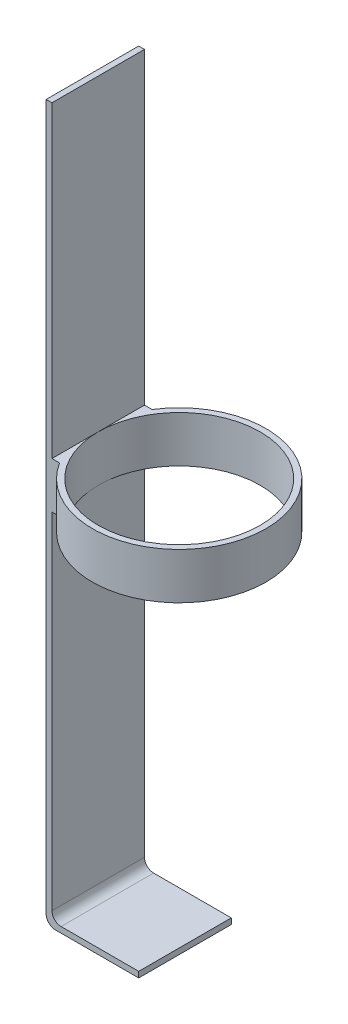
ISO-10303-21;
HEADER;
FILE_DESCRIPTION(('STEP AP214'),'2;1');
FILE_NAME('part.step','',(''),(''),'','','');
FILE_SCHEMA(('AUTOMOTIVE_DESIGN { 1 0 10303 214 1 1 1 1 }'));
ENDSEC;
DATA;
#1=APPLICATION_CONTEXT('core data for automotive mechanical design processes');
#2=APPLICATION_PROTOCOL_DEFINITION('international standard','automotive_design',2000,#1);
#3=PRODUCT_CONTEXT('',#1,'mechanical');
#4=PRODUCT('Part','Part','',(#3));
#5=PRODUCT_RELATED_PRODUCT_CATEGORY('part','',(#4));
#6=PRODUCT_DEFINITION_FORMATION('','',#4);
#7=PRODUCT_DEFINITION_CONTEXT('part definition',#1,'design');
#8=PRODUCT_DEFINITION('design','',#6,#7);
#9=PRODUCT_DEFINITION_SHAPE('','',#8);
#10=(LENGTH_UNIT() NAMED_UNIT(*) SI_UNIT(.MILLI.,.METRE.));
#11=(NAMED_UNIT(*) PLANE_ANGLE_UNIT() SI_UNIT($,.RADIAN.));
#12=(NAMED_UNIT(*) SI_UNIT($,.STERADIAN.) SOLID_ANGLE_UNIT());
#13=UNCERTAINTY_MEASURE_WITH_UNIT(LENGTH_MEASURE(1.E-05),#10,'distance_accuracy_value','');
#14=(GEOMETRIC_REPRESENTATION_CONTEXT(3) GLOBAL_UNCERTAINTY_ASSIGNED_CONTEXT((#13)) GLOBAL_UNIT_ASSIGNED_CONTEXT((#10,
#11,#12)) REPRESENTATION_CONTEXT('',''));
#15=CARTESIAN_POINT('',(0.,0.,0.));
#16=DIRECTION('',(0.,0.,1.));
#17=DIRECTION('',(1.,0.,0.));
#18=AXIS2_PLACEMENT_3D('',#15,#16,#17);
#19=CARTESIAN_POINT('',(3.175,0.,50.8));
#20=DIRECTION('',(1.,0.,0.));
#21=DIRECTION('',(0.,1.,0.));
#22=AXIS2_PLACEMENT_3D('',#19,#20,#21);
#23=PLANE('',#22);
#24=DIRECTION('',(0.,-1.,0.));
#25=VECTOR('',#24,1.);
#26=CARTESIAN_POINT('',(3.175,0.,0.));
#27=LINE('',#26,#25);
#28=CARTESIAN_POINT('',(3.17500000000002,-194.49375,0.));
#29=VERTEX_POINT('',#28);
#30=CARTESIAN_POINT('',(3.17500000000005,-383.9875,0.));
#31=VERTEX_POINT('',#30);
#32=EDGE_CURVE('E203',#29,#31,#27,.T.);
#33=ORIENTED_EDGE('',*,*,#32,.F.);
#34=DIRECTION('',(0.,0.,1.));
#35=VECTOR('',#34,1.);
#36=CARTESIAN_POINT('',(3.17500000000002,-194.49375,50.8));
#37=LINE('',#36,#35);
#38=CARTESIAN_POINT('',(3.17500000000003,-194.49375,25.4));
#39=VERTEX_POINT('',#38);
#40=EDGE_CURVE('E61',#29,#39,#37,.T.);
#41=ORIENTED_EDGE('',*,*,#40,.T.);
#42=CARTESIAN_POINT('',(3.175,-194.49375,50.8));
#43=VERTEX_POINT('',#42);
#44=EDGE_CURVE('E136',#39,#43,#37,.T.);
#45=ORIENTED_EDGE('',*,*,#44,.T.);
#46=DIRECTION('',(0.,-1.,0.));
#47=VECTOR('',#46,1.);
#48=CARTESIAN_POINT('',(3.175,0.,50.8));
#49=LINE('',#48,#47);
#50=CARTESIAN_POINT('',(3.17500000000005,-383.9875,50.8));
#51=VERTEX_POINT('',#50);
#52=EDGE_CURVE('E128',#43,#51,#49,.T.);
#53=ORIENTED_EDGE('',*,*,#52,.T.);
#54=DIRECTION('',(0.,0.,-1.));
#55=VECTOR('',#54,1.);
#56=CARTESIAN_POINT('',(3.17500000000005,-383.9875,50.8));
#57=LINE('',#56,#55);
#58=EDGE_CURVE('E132',#51,#31,#57,.T.);
#59=ORIENTED_EDGE('',*,*,#58,.T.);
#60=EDGE_LOOP('',(#33,#41,#45,#53,#59));
#61=FACE_BOUND('',#60,.T.);
#62=ADVANCED_FACE('F45',(#61),#23,.T.);
#63=CARTESIAN_POINT('',(0.,0.,50.8));
#64=DIRECTION('',(1.,0.,0.));
#65=DIRECTION('',(0.,1.,0.));
#66=AXIS2_PLACEMENT_3D('',#63,#64,#65);
#67=PLANE('',#66);
#68=DIRECTION('',(0.,-1.,0.));
#69=VECTOR('',#68,1.);
#70=CARTESIAN_POINT('',(0.,0.,0.));
#71=LINE('',#70,#69);
#72=CARTESIAN_POINT('',(0.,0.,0.));
#73=VERTEX_POINT('',#72);
#74=CARTESIAN_POINT('',(0.,-387.1625,0.));
#75=VERTEX_POINT('',#74);
#76=EDGE_CURVE('E195',#73,#75,#71,.T.);
#77=ORIENTED_EDGE('',*,*,#76,.T.);
#78=DIRECTION('',(0.,0.,-1.));
#79=VECTOR('',#78,1.);
#80=CARTESIAN_POINT('',(0.,-387.1625,50.8));
#81=LINE('',#80,#79);
#82=CARTESIAN_POINT('',(0.,-387.1625,50.8));
#83=VERTEX_POINT('',#82);
#84=EDGE_CURVE('E11',#83,#75,#81,.T.);
#85=ORIENTED_EDGE('',*,*,#84,.F.);
#86=DIRECTION('',(0.,-1.,0.));
#87=VECTOR('',#86,1.);
#88=CARTESIAN_POINT('',(0.,0.,50.8));
#89=LINE('',#88,#87);
#90=CARTESIAN_POINT('',(0.,0.,50.8));
#91=VERTEX_POINT('',#90);
#92=EDGE_CURVE('E211',#91,#83,#89,.T.);
#93=ORIENTED_EDGE('',*,*,#92,.F.);
#94=DIRECTION('',(0.,0.,-1.));
#95=VECTOR('',#94,1.);
#96=CARTESIAN_POINT('',(0.,0.,50.8));
#97=LINE('',#96,#95);
#98=EDGE_CURVE('E70',#91,#73,#97,.T.);
#99=ORIENTED_EDGE('',*,*,#98,.T.);
#100=EDGE_LOOP('',(#77,#85,#93,#99));
#101=FACE_BOUND('',#100,.T.);
#102=ADVANCED_FACE('F47',(#101),#67,.F.);
#103=CARTESIAN_POINT('',(5.00000000000007,-387.1625,50.8));
#104=DIRECTION('',(0.,0.,-1.));
#105=DIRECTION('',(-1.,0.,0.));
#106=AXIS2_PLACEMENT_3D('',#103,#104,#105);
#107=CYLINDRICAL_SURFACE('',#106,5.00000000000003);
#108=CARTESIAN_POINT('',(5.00000000000007,-387.1625,0.));
#109=DIRECTION('',(0.,0.,1.));
#110=DIRECTION('',(1.,0.,0.));
#111=AXIS2_PLACEMENT_3D('',#108,#109,#110);
#112=CIRCLE('',#111,5.00000000000003);
#113=CARTESIAN_POINT('',(5.00000000000007,-392.1625,0.));
#114=VERTEX_POINT('',#113);
#115=EDGE_CURVE('E185',#75,#114,#112,.T.);
#116=ORIENTED_EDGE('',*,*,#115,.T.);
#117=DIRECTION('',(0.,0.,-1.));
#118=VECTOR('',#117,1.);
#119=CARTESIAN_POINT('',(5.00000000000007,-392.1625,50.8));
#120=LINE('',#119,#118);
#121=CARTESIAN_POINT('',(5.00000000000007,-392.1625,50.8));
#122=VERTEX_POINT('',#121);
#123=EDGE_CURVE('E54',#122,#114,#120,.T.);
#124=ORIENTED_EDGE('',*,*,#123,.F.);
#125=CARTESIAN_POINT('',(5.00000000000007,-387.1625,50.8));
#126=DIRECTION('',(0.,0.,1.));
#127=DIRECTION('',(1.,0.,0.));
#128=AXIS2_PLACEMENT_3D('',#125,#126,#127);
#129=CIRCLE('',#128,5.00000000000003);
#130=EDGE_CURVE('E109',#83,#122,#129,.T.);
#131=ORIENTED_EDGE('',*,*,#130,.F.);
#132=ORIENTED_EDGE('',*,*,#84,.T.);
#133=EDGE_LOOP('',(#116,#124,#131,#132));
#134=FACE_BOUND('',#133,.T.);
#135=ADVANCED_FACE('F308',(#134),#107,.T.);
#136=CARTESIAN_POINT('',(0.,-392.1625,50.8));
#137=DIRECTION('',(0.,1.,0.));
#138=DIRECTION('',(0.,0.,1.));
#139=AXIS2_PLACEMENT_3D('',#136,#137,#138);
#140=PLANE('',#139);
#141=DIRECTION('',(1.,0.,0.));
#142=VECTOR('',#141,1.);
#143=CARTESIAN_POINT('',(0.,-392.1625,0.));
#144=LINE('',#143,#142);
#145=CARTESIAN_POINT('',(50.8000000000001,-392.1625,0.));
#146=VERTEX_POINT('',#145);
#147=EDGE_CURVE('E180',#114,#146,#144,.T.);
#148=ORIENTED_EDGE('',*,*,#147,.T.);
#149=DIRECTION('',(0.,0.,-1.));
#150=VECTOR('',#149,1.);
#151=CARTESIAN_POINT('',(50.8000000000001,-392.1625,50.8));
#152=LINE('',#151,#150);
#153=CARTESIAN_POINT('',(50.8000000000001,-392.1625,50.8));
#154=VERTEX_POINT('',#153);
#155=EDGE_CURVE('E170',#154,#146,#152,.T.);
#156=ORIENTED_EDGE('',*,*,#155,.F.);
#157=DIRECTION('',(1.,0.,0.));
#158=VECTOR('',#157,1.);
#159=CARTESIAN_POINT('',(0.,-392.1625,50.8));
#160=LINE('',#159,#158);
#161=EDGE_CURVE('E182',#122,#154,#160,.T.);
#162=ORIENTED_EDGE('',*,*,#161,.F.);
#163=ORIENTED_EDGE('',*,*,#123,.T.);
#164=EDGE_LOOP('',(#148,#156,#162,#163));
#165=FACE_BOUND('',#164,.T.);
#166=ADVANCED_FACE('F178',(#165),#140,.F.);
#167=CARTESIAN_POINT('',(50.8,0.,50.8));
#168=DIRECTION('',(1.,0.,0.));
#169=DIRECTION('',(0.,1.,0.));
#170=AXIS2_PLACEMENT_3D('',#167,#168,#169);
#171=PLANE('',#170);
#172=DIRECTION('',(0.,-1.,0.));
#173=VECTOR('',#172,1.);
#174=CARTESIAN_POINT('',(50.8,0.,0.));
#175=LINE('',#174,#173);
#176=CARTESIAN_POINT('',(50.8000000000001,-388.9875,0.));
#177=VERTEX_POINT('',#176);
#178=EDGE_CURVE('E188',#177,#146,#175,.T.);
#179=ORIENTED_EDGE('',*,*,#178,.F.);
#180=DIRECTION('',(0.,0.,-1.));
#181=VECTOR('',#180,1.);
#182=CARTESIAN_POINT('',(50.8000000000001,-388.9875,50.8));
#183=LINE('',#182,#181);
#184=CARTESIAN_POINT('',(50.8000000000001,-388.9875,50.8));
#185=VERTEX_POINT('',#184);
#186=EDGE_CURVE('E163',#185,#177,#183,.T.);
#187=ORIENTED_EDGE('',*,*,#186,.F.);
#188=DIRECTION('',(0.,-1.,0.));
#189=VECTOR('',#188,1.);
#190=CARTESIAN_POINT('',(50.8,0.,50.8));
#191=LINE('',#190,#189);
#192=EDGE_CURVE('E235',#185,#154,#191,.T.);
#193=ORIENTED_EDGE('',*,*,#192,.T.);
#194=ORIENTED_EDGE('',*,*,#155,.T.);
#195=EDGE_LOOP('',(#179,#187,#193,#194));
#196=FACE_BOUND('',#195,.T.);
#197=ADVANCED_FACE('F321',(#196),#171,.T.);
#198=CARTESIAN_POINT('',(0.,-388.9875,50.8));
#199=DIRECTION('',(0.,-1.,0.));
#200=DIRECTION('',(0.,0.,-1.));
#201=AXIS2_PLACEMENT_3D('',#198,#199,#200);
#202=PLANE('',#201);
#203=DIRECTION('',(-1.,0.,0.));
#204=VECTOR('',#203,1.);
#205=CARTESIAN_POINT('',(0.,-388.9875,0.));
#206=LINE('',#205,#204);
#207=CARTESIAN_POINT('',(8.17500000000005,-388.9875,0.));
#208=VERTEX_POINT('',#207);
#209=EDGE_CURVE('E193',#177,#208,#206,.T.);
#210=ORIENTED_EDGE('',*,*,#209,.T.);
#211=DIRECTION('',(0.,0.,-1.));
#212=VECTOR('',#211,1.);
#213=CARTESIAN_POINT('',(8.17500000000005,-388.9875,50.8));
#214=LINE('',#213,#212);
#215=CARTESIAN_POINT('',(8.17500000000005,-388.9875,50.8));
#216=VERTEX_POINT('',#215);
#217=EDGE_CURVE('E158',#216,#208,#214,.T.);
#218=ORIENTED_EDGE('',*,*,#217,.F.);
#219=DIRECTION('',(-1.,0.,0.));
#220=VECTOR('',#219,1.);
#221=CARTESIAN_POINT('',(0.,-388.9875,50.8));
#222=LINE('',#221,#220);
#223=EDGE_CURVE('E148',#185,#216,#222,.T.);
#224=ORIENTED_EDGE('',*,*,#223,.F.);
#225=ORIENTED_EDGE('',*,*,#186,.T.);
#226=EDGE_LOOP('',(#210,#218,#224,#225));
#227=FACE_BOUND('',#226,.T.);
#228=ADVANCED_FACE('F317',(#227),#202,.F.);
#229=CARTESIAN_POINT('',(8.17500000000005,-383.9875,50.8));
#230=DIRECTION('',(0.,0.,-1.));
#231=DIRECTION('',(-1.,0.,0.));
#232=AXIS2_PLACEMENT_3D('',#229,#230,#231);
#233=CYLINDRICAL_SURFACE('',#232,5.);
#234=CARTESIAN_POINT('',(8.17500000000005,-383.9875,0.));
#235=DIRECTION('',(0.,0.,1.));
#236=DIRECTION('',(1.,0.,0.));
#237=AXIS2_PLACEMENT_3D('',#234,#235,#236);
#238=CIRCLE('',#237,5.);
#239=EDGE_CURVE('E156',#208,#31,#238,.F.);
#240=ORIENTED_EDGE('',*,*,#239,.T.);
#241=ORIENTED_EDGE('',*,*,#58,.F.);
#242=CARTESIAN_POINT('',(8.17500000000005,-383.9875,50.8));
#243=DIRECTION('',(0.,0.,1.));
#244=DIRECTION('',(1.,0.,0.));
#245=AXIS2_PLACEMENT_3D('',#242,#243,#244);
#246=CIRCLE('',#245,5.);
#247=EDGE_CURVE('E142',#216,#51,#246,.F.);
#248=ORIENTED_EDGE('',*,*,#247,.F.);
#249=ORIENTED_EDGE('',*,*,#217,.T.);
#250=EDGE_LOOP('',(#240,#241,#248,#249));
#251=FACE_BOUND('',#250,.T.);
#252=ADVANCED_FACE('F154',(#251),#233,.F.);
#253=DIRECTION('',(0.,0.,-1.));
#254=VECTOR('',#253,1.);
#255=CARTESIAN_POINT('',(3.175,-169.09375,0.));
#256=LINE('',#255,#254);
#257=CARTESIAN_POINT('',(3.17500000000002,-169.09375,25.4));
#258=VERTEX_POINT('',#257);
#259=CARTESIAN_POINT('',(3.175,-169.09375,0.));
#260=VERTEX_POINT('',#259);
#261=EDGE_CURVE('E262',#258,#260,#256,.T.);
#262=ORIENTED_EDGE('',*,*,#261,.T.);
#263=CARTESIAN_POINT('',(3.175,0.,0.));
#264=VERTEX_POINT('',#263);
#265=EDGE_CURVE('E204',#264,#260,#27,.T.);
#266=ORIENTED_EDGE('',*,*,#265,.F.);
#267=DIRECTION('',(0.,0.,-1.));
#268=VECTOR('',#267,1.);
#269=CARTESIAN_POINT('',(3.175,0.,50.8));
#270=LINE('',#269,#268);
#271=CARTESIAN_POINT('',(3.175,0.,50.8));
#272=VERTEX_POINT('',#271);
#273=EDGE_CURVE('E159',#272,#264,#270,.T.);
#274=ORIENTED_EDGE('',*,*,#273,.F.);
#275=CARTESIAN_POINT('',(3.175,-169.09375,50.8));
#276=VERTEX_POINT('',#275);
#277=EDGE_CURVE('E141',#272,#276,#49,.T.);
#278=ORIENTED_EDGE('',*,*,#277,.T.);
#279=DIRECTION('',(0.,0.,-1.));
#280=VECTOR('',#279,1.);
#281=CARTESIAN_POINT('',(3.175,-169.09375,0.));
#282=LINE('',#281,#280);
#283=EDGE_CURVE('E256',#276,#258,#282,.T.);
#284=ORIENTED_EDGE('',*,*,#283,.T.);
#285=EDGE_LOOP('',(#262,#266,#274,#278,#284));
#286=FACE_BOUND('',#285,.T.);
#287=ADVANCED_FACE('F304',(#286),#23,.T.);
#288=CARTESIAN_POINT('',(0.,0.,50.8));
#289=DIRECTION('',(0.,1.,0.));
#290=DIRECTION('',(0.,0.,1.));
#291=AXIS2_PLACEMENT_3D('',#288,#289,#290);
#292=PLANE('',#291);
#293=DIRECTION('',(1.,0.,0.));
#294=VECTOR('',#293,1.);
#295=CARTESIAN_POINT('',(0.,0.,0.));
#296=LINE('',#295,#294);
#297=EDGE_CURVE('E208',#73,#264,#296,.T.);
#298=ORIENTED_EDGE('',*,*,#297,.F.);
#299=ORIENTED_EDGE('',*,*,#98,.F.);
#300=DIRECTION('',(1.,0.,0.));
#301=VECTOR('',#300,1.);
#302=CARTESIAN_POINT('',(0.,0.,50.8));
#303=LINE('',#302,#301);
#304=EDGE_CURVE('E213',#91,#272,#303,.T.);
#305=ORIENTED_EDGE('',*,*,#304,.T.);
#306=ORIENTED_EDGE('',*,*,#273,.T.);
#307=EDGE_LOOP('',(#298,#299,#305,#306));
#308=FACE_BOUND('',#307,.T.);
#309=ADVANCED_FACE('F312',(#308),#292,.T.);
#310=CARTESIAN_POINT('',(0.,0.,50.8));
#311=DIRECTION('',(0.,0.,1.));
#312=DIRECTION('',(1.,0.,0.));
#313=AXIS2_PLACEMENT_3D('',#310,#311,#312);
#314=PLANE('',#313);
#315=ORIENTED_EDGE('',*,*,#92,.T.);
#316=ORIENTED_EDGE('',*,*,#130,.T.);
#317=ORIENTED_EDGE('',*,*,#161,.T.);
#318=ORIENTED_EDGE('',*,*,#192,.F.);
#319=ORIENTED_EDGE('',*,*,#223,.T.);
#320=ORIENTED_EDGE('',*,*,#247,.T.);
#321=ORIENTED_EDGE('',*,*,#52,.F.);
#322=DIRECTION('',(1.,0.,0.));
#323=VECTOR('',#322,1.);
#324=CARTESIAN_POINT('',(0.,-194.49375,50.8));
#325=LINE('',#324,#323);
#326=CARTESIAN_POINT('',(7.33876630907279,-194.49375,50.8));
#327=VERTEX_POINT('',#326);
#328=EDGE_CURVE('E258',#43,#327,#325,.T.);
#329=ORIENTED_EDGE('',*,*,#328,.T.);
#330=DIRECTION('',(0.,-1.,0.));
#331=VECTOR('',#330,1.);
#332=CARTESIAN_POINT('',(7.33876630907279,-169.09375,50.8));
#333=LINE('',#332,#331);
#334=CARTESIAN_POINT('',(7.33876630907279,-169.09375,50.8));
#335=VERTEX_POINT('',#334);
#336=EDGE_CURVE('E225',#335,#327,#333,.T.);
#337=ORIENTED_EDGE('',*,*,#336,.F.);
#338=DIRECTION('',(1.,0.,0.));
#339=VECTOR('',#338,1.);
#340=CARTESIAN_POINT('',(0.,-169.09375,50.8));
#341=LINE('',#340,#339);
#342=EDGE_CURVE('E335',#276,#335,#341,.T.);
#343=ORIENTED_EDGE('',*,*,#342,.F.);
#344=ORIENTED_EDGE('',*,*,#277,.F.);
#345=ORIENTED_EDGE('',*,*,#304,.F.);
#346=EDGE_LOOP('',(#315,#316,#317,#318,#319,#320,#321,#329,#337,#343,#344,#345));
#347=FACE_BOUND('',#346,.T.);
#348=ADVANCED_FACE('F145',(#347),#314,.T.);
#349=CARTESIAN_POINT('',(0.,0.,0.));
#350=DIRECTION('',(0.,0.,1.));
#351=DIRECTION('',(1.,0.,0.));
#352=AXIS2_PLACEMENT_3D('',#349,#350,#351);
#353=PLANE('',#352);
#354=ORIENTED_EDGE('',*,*,#76,.F.);
#355=ORIENTED_EDGE('',*,*,#297,.T.);
#356=ORIENTED_EDGE('',*,*,#265,.T.);
#357=DIRECTION('',(1.,0.,0.));
#358=VECTOR('',#357,1.);
#359=CARTESIAN_POINT('',(0.,-169.09375,0.));
#360=LINE('',#359,#358);
#361=CARTESIAN_POINT('',(7.3387663090728,-169.09375,0.));
#362=VERTEX_POINT('',#361);
#363=EDGE_CURVE('E267',#260,#362,#360,.T.);
#364=ORIENTED_EDGE('',*,*,#363,.T.);
#365=DIRECTION('',(0.,-1.,0.));
#366=VECTOR('',#365,1.);
#367=CARTESIAN_POINT('',(7.3387663090728,-169.09375,0.));
#368=LINE('',#367,#366);
#369=CARTESIAN_POINT('',(7.3387663090728,-194.49375,0.));
#370=VERTEX_POINT('',#369);
#371=EDGE_CURVE('E246',#362,#370,#368,.T.);
#372=ORIENTED_EDGE('',*,*,#371,.T.);
#373=DIRECTION('',(1.,0.,0.));
#374=VECTOR('',#373,1.);
#375=CARTESIAN_POINT('',(0.,-194.49375,0.));
#376=LINE('',#375,#374);
#377=EDGE_CURVE('E242',#29,#370,#376,.T.);
#378=ORIENTED_EDGE('',*,*,#377,.F.);
#379=ORIENTED_EDGE('',*,*,#32,.T.);
#380=ORIENTED_EDGE('',*,*,#239,.F.);
#381=ORIENTED_EDGE('',*,*,#209,.F.);
#382=ORIENTED_EDGE('',*,*,#178,.T.);
#383=ORIENTED_EDGE('',*,*,#147,.F.);
#384=ORIENTED_EDGE('',*,*,#115,.F.);
#385=EDGE_LOOP('',(#354,#355,#356,#364,#372,#378,#379,#380,#381,#382,#383,#384));
#386=FACE_BOUND('',#385,.T.);
#387=ADVANCED_FACE('F184',(#386),#353,.F.);
#388=CARTESIAN_POINT('',(47.625,-169.09375,25.4));
#389=DIRECTION('',(0.,-1.,0.));
#390=DIRECTION('',(0.,0.,-1.));
#391=AXIS2_PLACEMENT_3D('',#388,#389,#390);
#392=CYLINDRICAL_SURFACE('',#391,47.625);
#393=CARTESIAN_POINT('',(47.625,-194.49375,25.4));
#394=DIRECTION('',(0.,1.,0.));
#395=DIRECTION('',(0.,0.,1.));
#396=AXIS2_PLACEMENT_3D('',#393,#394,#395);
#397=CIRCLE('',#396,47.625);
#398=EDGE_CURVE('E251',#327,#370,#397,.T.);
#399=ORIENTED_EDGE('',*,*,#398,.T.);
#400=ORIENTED_EDGE('',*,*,#371,.F.);
#401=CARTESIAN_POINT('',(47.625,-169.09375,25.4));
#402=DIRECTION('',(0.,1.,0.));
#403=DIRECTION('',(0.,0.,1.));
#404=AXIS2_PLACEMENT_3D('',#401,#402,#403);
#405=CIRCLE('',#404,47.625);
#406=EDGE_CURVE('E275',#335,#362,#405,.T.);
#407=ORIENTED_EDGE('',*,*,#406,.F.);
#408=ORIENTED_EDGE('',*,*,#336,.T.);
#409=EDGE_LOOP('',(#399,#400,#407,#408));
#410=FACE_BOUND('',#409,.T.);
#411=ADVANCED_FACE('F289',(#410),#392,.T.);
#412=CARTESIAN_POINT('',(47.625,-169.09375,25.4));
#413=DIRECTION('',(0.,-1.,0.));
#414=DIRECTION('',(0.,0.,-1.));
#415=AXIS2_PLACEMENT_3D('',#412,#413,#414);
#416=CYLINDRICAL_SURFACE('',#415,44.45);
#417=CARTESIAN_POINT('',(47.625,-169.09375,25.4));
#418=DIRECTION('',(0.,1.,0.));
#419=DIRECTION('',(0.,0.,1.));
#420=AXIS2_PLACEMENT_3D('',#417,#418,#419);
#421=CIRCLE('',#420,44.45);
#422=EDGE_CURVE('E250',#258,#258,#421,.T.);
#423=ORIENTED_EDGE('',*,*,#422,.T.);
#424=EDGE_LOOP('',(#423));
#425=FACE_BOUND('',#424,.T.);
#426=CARTESIAN_POINT('',(47.625,-194.49375,25.4));
#427=DIRECTION('',(0.,1.,0.));
#428=DIRECTION('',(0.,0.,1.));
#429=AXIS2_PLACEMENT_3D('',#426,#427,#428);
#430=CIRCLE('',#429,44.45);
#431=EDGE_CURVE('E279',#39,#39,#430,.T.);
#432=ORIENTED_EDGE('',*,*,#431,.F.);
#433=EDGE_LOOP('',(#432));
#434=FACE_BOUND('',#433,.T.);
#435=ADVANCED_FACE('F298',(#425,#434),#416,.F.);
#436=CARTESIAN_POINT('',(0.,-169.09375,0.));
#437=DIRECTION('',(0.,1.,0.));
#438=DIRECTION('',(0.,0.,1.));
#439=AXIS2_PLACEMENT_3D('',#436,#437,#438);
#440=PLANE('',#439);
#441=ORIENTED_EDGE('',*,*,#261,.F.);
#442=ORIENTED_EDGE('',*,*,#422,.F.);
#443=ORIENTED_EDGE('',*,*,#283,.F.);
#444=ORIENTED_EDGE('',*,*,#342,.T.);
#445=ORIENTED_EDGE('',*,*,#406,.T.);
#446=ORIENTED_EDGE('',*,*,#363,.F.);
#447=EDGE_LOOP('',(#441,#442,#443,#444,#445,#446));
#448=FACE_BOUND('',#447,.T.);
#449=ADVANCED_FACE('F293',(#448),#440,.T.);
#450=CARTESIAN_POINT('',(0.,-194.49375,0.));
#451=DIRECTION('',(0.,1.,0.));
#452=DIRECTION('',(0.,0.,1.));
#453=AXIS2_PLACEMENT_3D('',#450,#451,#452);
#454=PLANE('',#453);
#455=ORIENTED_EDGE('',*,*,#40,.F.);
#456=ORIENTED_EDGE('',*,*,#377,.T.);
#457=ORIENTED_EDGE('',*,*,#398,.F.);
#458=ORIENTED_EDGE('',*,*,#328,.F.);
#459=ORIENTED_EDGE('',*,*,#44,.F.);
#460=ORIENTED_EDGE('',*,*,#431,.T.);
#461=EDGE_LOOP('',(#455,#456,#457,#458,#459,#460));
#462=FACE_BOUND('',#461,.T.);
#463=ADVANCED_FACE('F291',(#462),#454,.F.);
#464=CLOSED_SHELL('',(#62,#102,#135,#166,#197,#228,#252,#287,#309,#348,#387,#411,#435,#449,#463));
#465=MANIFOLD_SOLID_BREP('B2',#464);
#466=ADVANCED_BREP_SHAPE_REPRESENTATION('',(#18,#465),#14);
#467=SHAPE_DEFINITION_REPRESENTATION(#9,#466);
ENDSEC;
END-ISO-10303-21;
